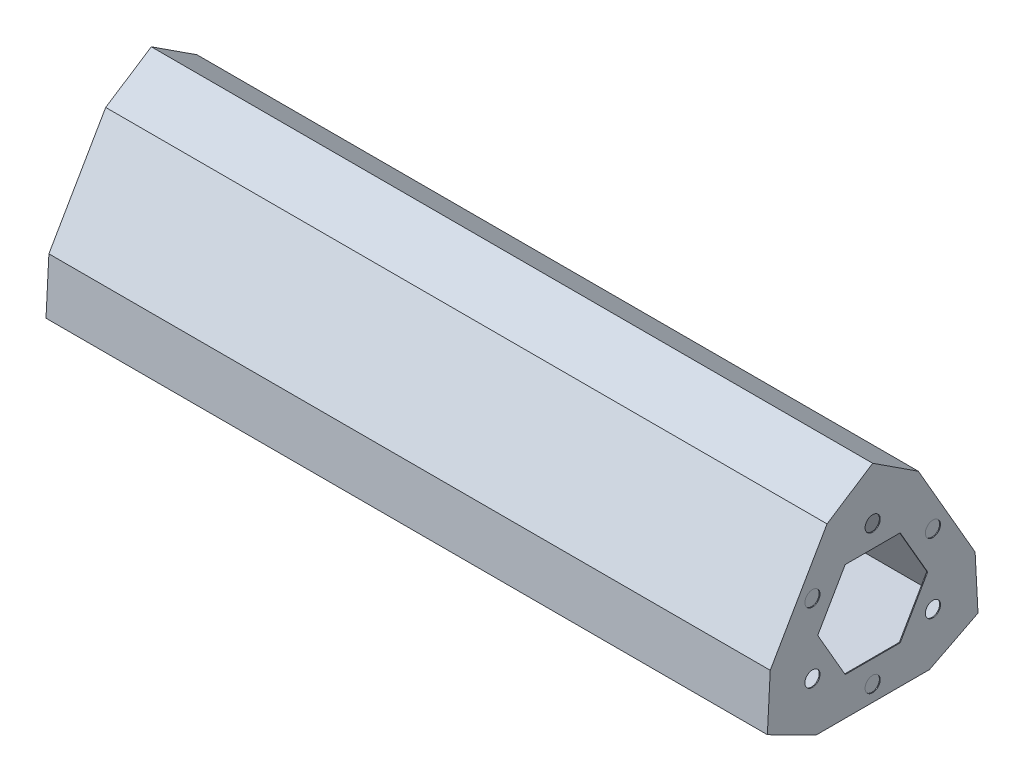
ISO-10303-21;
HEADER;
FILE_DESCRIPTION(('STEP AP214'),'2;1');
FILE_NAME('part.step','',(''),(''),'','','');
FILE_SCHEMA(('AUTOMOTIVE_DESIGN { 1 0 10303 214 1 1 1 1 }'));
ENDSEC;
DATA;
#1=APPLICATION_CONTEXT('core data for automotive mechanical design processes');
#2=APPLICATION_PROTOCOL_DEFINITION('international standard','automotive_design',2000,#1);
#3=PRODUCT_CONTEXT('',#1,'mechanical');
#4=PRODUCT('Part','Part','',(#3));
#5=PRODUCT_RELATED_PRODUCT_CATEGORY('part','',(#4));
#6=PRODUCT_DEFINITION_FORMATION('','',#4);
#7=PRODUCT_DEFINITION_CONTEXT('part definition',#1,'design');
#8=PRODUCT_DEFINITION('design','',#6,#7);
#9=PRODUCT_DEFINITION_SHAPE('','',#8);
#10=(LENGTH_UNIT() NAMED_UNIT(*) SI_UNIT(.MILLI.,.METRE.));
#11=(NAMED_UNIT(*) PLANE_ANGLE_UNIT() SI_UNIT($,.RADIAN.));
#12=(NAMED_UNIT(*) SI_UNIT($,.STERADIAN.) SOLID_ANGLE_UNIT());
#13=UNCERTAINTY_MEASURE_WITH_UNIT(LENGTH_MEASURE(1.E-05),#10,'distance_accuracy_value','');
#14=(GEOMETRIC_REPRESENTATION_CONTEXT(3) GLOBAL_UNCERTAINTY_ASSIGNED_CONTEXT((#13)) GLOBAL_UNIT_ASSIGNED_CONTEXT((#10,
#11,#12)) REPRESENTATION_CONTEXT('',''));
#15=CARTESIAN_POINT('',(0.,0.,0.));
#16=DIRECTION('',(0.,0.,1.));
#17=DIRECTION('',(1.,0.,0.));
#18=AXIS2_PLACEMENT_3D('',#15,#16,#17);
#19=CARTESIAN_POINT('',(152.4,21.8761469360305,-37.8905979670466));
#20=DIRECTION('',(0.,-0.500000000000005,0.866025403784435));
#21=DIRECTION('',(0.,-0.866025403784436,-0.500000000000006));
#22=AXIS2_PLACEMENT_3D('',#19,#20,#21);
#23=PLANE('',#22);
#24=DIRECTION('',(0.,0.866025403784436,0.500000000000006));
#25=VECTOR('',#24,1.);
#26=CARTESIAN_POINT('',(0.,21.8761469360305,-37.8905979670466));
#27=LINE('',#26,#25);
#28=CARTESIAN_POINT('',(0.,11.4838420906171,-43.8905979670468));
#29=VERTEX_POINT('',#28);
#30=CARTESIAN_POINT('',(0.,32.2684517814436,-31.8905979670466));
#31=VERTEX_POINT('',#30);
#32=EDGE_CURVE('E297',#29,#31,#27,.T.);
#33=ORIENTED_EDGE('',*,*,#32,.T.);
#34=DIRECTION('',(-1.,0.,0.));
#35=VECTOR('',#34,1.);
#36=CARTESIAN_POINT('',(152.4,32.2684517814436,-31.8905979670466));
#37=LINE('',#36,#35);
#38=CARTESIAN_POINT('',(152.4,32.2684517814436,-31.8905979670466));
#39=VERTEX_POINT('',#38);
#40=EDGE_CURVE('E12',#39,#31,#37,.T.);
#41=ORIENTED_EDGE('',*,*,#40,.F.);
#42=DIRECTION('',(0.,0.866025403784436,0.500000000000006));
#43=VECTOR('',#42,1.);
#44=CARTESIAN_POINT('',(152.4,21.8761469360305,-37.8905979670466));
#45=LINE('',#44,#43);
#46=CARTESIAN_POINT('',(152.4,11.4838420906171,-43.8905979670468));
#47=VERTEX_POINT('',#46);
#48=EDGE_CURVE('E308',#47,#39,#45,.T.);
#49=ORIENTED_EDGE('',*,*,#48,.F.);
#50=DIRECTION('',(-1.,0.,0.));
#51=VECTOR('',#50,1.);
#52=CARTESIAN_POINT('',(152.4,11.4838420906171,-43.8905979670468));
#53=LINE('',#52,#51);
#54=EDGE_CURVE('E330',#47,#29,#53,.T.);
#55=ORIENTED_EDGE('',*,*,#54,.T.);
#56=EDGE_LOOP('',(#33,#41,#49,#55));
#57=FACE_BOUND('',#56,.T.);
#58=ADVANCED_FACE('F39',(#57),#23,.F.);
#59=CARTESIAN_POINT('',(152.4,37.2525078239312,-24.2268431001882));
#60=DIRECTION('',(0.,-0.838312866699757,0.545189451040311));
#61=DIRECTION('',(0.,-0.545189451040311,-0.838312866699757));
#62=AXIS2_PLACEMENT_3D('',#59,#60,#61);
#63=PLANE('',#62);
#64=DIRECTION('',(0.,0.545189451040311,0.838312866699757));
#65=VECTOR('',#64,1.);
#66=CARTESIAN_POINT('',(0.,37.2525078239312,-24.2268431001882));
#67=LINE('',#66,#65);
#68=CARTESIAN_POINT('',(0.,38.5381304684071,-22.2499999999991));
#69=VERTEX_POINT('',#68);
#70=EDGE_CURVE('E333',#31,#69,#67,.T.);
#71=ORIENTED_EDGE('',*,*,#70,.T.);
#72=DIRECTION('',(-1.,0.,0.));
#73=VECTOR('',#72,1.);
#74=CARTESIAN_POINT('',(152.4,38.5381304684071,-22.2499999999991));
#75=LINE('',#74,#73);
#76=CARTESIAN_POINT('',(152.4,38.5381304684071,-22.2499999999991));
#77=VERTEX_POINT('',#76);
#78=EDGE_CURVE('E46',#77,#69,#75,.T.);
#79=ORIENTED_EDGE('',*,*,#78,.F.);
#80=DIRECTION('',(0.,0.545189451040311,0.838312866699757));
#81=VECTOR('',#80,1.);
#82=CARTESIAN_POINT('',(152.4,37.2525078239312,-24.2268431001882));
#83=LINE('',#82,#81);
#84=EDGE_CURVE('E311',#39,#77,#83,.T.);
#85=ORIENTED_EDGE('',*,*,#84,.F.);
#86=ORIENTED_EDGE('',*,*,#40,.T.);
#87=EDGE_LOOP('',(#71,#79,#85,#86));
#88=FACE_BOUND('',#87,.T.);
#89=ADVANCED_FACE('F374',(#88),#63,.F.);
#90=CARTESIAN_POINT('',(152.4,16.9142575679085,11.0000396802978));
#91=DIRECTION('',(0.,0.838312866699781,0.545189451040274));
#92=DIRECTION('',(0.,-0.545189451040274,0.838312866699781));
#93=AXIS2_PLACEMENT_3D('',#90,#91,#92);
#94=PLANE('',#93);
#95=DIRECTION('',(0.,0.545189451040274,-0.838312866699781));
#96=VECTOR('',#95,1.);
#97=CARTESIAN_POINT('',(0.,16.9142575679085,11.0000396802978));
#98=LINE('',#97,#96);
#99=CARTESIAN_POINT('',(0.,32.2684517814438,-12.6094020329519));
#100=VERTEX_POINT('',#99);
#101=EDGE_CURVE('E336',#100,#69,#98,.T.);
#102=ORIENTED_EDGE('',*,*,#101,.F.);
#103=DIRECTION('',(-1.,0.,0.));
#104=VECTOR('',#103,1.);
#105=CARTESIAN_POINT('',(152.4,32.2684517814438,-12.6094020329519));
#106=LINE('',#105,#104);
#107=CARTESIAN_POINT('',(152.4,32.2684517814438,-12.6094020329519));
#108=VERTEX_POINT('',#107);
#109=EDGE_CURVE('E367',#108,#100,#106,.T.);
#110=ORIENTED_EDGE('',*,*,#109,.F.);
#111=DIRECTION('',(0.,0.545189451040274,-0.838312866699781));
#112=VECTOR('',#111,1.);
#113=CARTESIAN_POINT('',(152.4,16.9142575679085,11.0000396802978));
#114=LINE('',#113,#112);
#115=EDGE_CURVE('E314',#108,#77,#114,.T.);
#116=ORIENTED_EDGE('',*,*,#115,.T.);
#117=ORIENTED_EDGE('',*,*,#78,.T.);
#118=EDGE_LOOP('',(#102,#110,#116,#117));
#119=FACE_BOUND('',#118,.T.);
#120=ADVANCED_FACE('F371',(#119),#94,.T.);
#121=CARTESIAN_POINT('',(152.4,2.60708170182693,4.51559796704751));
#122=DIRECTION('',(0.,0.49999999999999,0.866025403784444));
#123=DIRECTION('',(0.,-0.866025403784445,0.49999999999999));
#124=AXIS2_PLACEMENT_3D('',#121,#122,#123);
#125=PLANE('',#124);
#126=DIRECTION('',(0.,0.866025403784445,-0.49999999999999));
#127=VECTOR('',#126,1.);
#128=CARTESIAN_POINT('',(0.,2.60708170182693,4.51559796704751));
#129=LINE('',#128,#127);
#130=CARTESIAN_POINT('',(0.,11.4838420906171,-0.609402032952183));
#131=VERTEX_POINT('',#130);
#132=EDGE_CURVE('E339',#131,#100,#129,.T.);
#133=ORIENTED_EDGE('',*,*,#132,.F.);
#134=DIRECTION('',(-1.,0.,0.));
#135=VECTOR('',#134,1.);
#136=CARTESIAN_POINT('',(152.4,11.4838420906171,-0.609402032952183));
#137=LINE('',#136,#135);
#138=CARTESIAN_POINT('',(152.4,11.4838420906171,-0.609402032952183));
#139=VERTEX_POINT('',#138);
#140=EDGE_CURVE('E365',#139,#131,#137,.T.);
#141=ORIENTED_EDGE('',*,*,#140,.F.);
#142=DIRECTION('',(0.,0.866025403784445,-0.49999999999999));
#143=VECTOR('',#142,1.);
#144=CARTESIAN_POINT('',(152.4,2.60708170182693,4.51559796704751));
#145=LINE('',#144,#143);
#146=EDGE_CURVE('E317',#139,#108,#145,.T.);
#147=ORIENTED_EDGE('',*,*,#146,.T.);
#148=ORIENTED_EDGE('',*,*,#109,.T.);
#149=EDGE_LOOP('',(#133,#141,#147,#148));
#150=FACE_BOUND('',#149,.T.);
#151=ADVANCED_FACE('F383',(#150),#125,.T.);
#152=CARTESIAN_POINT('',(152.4,0.,0.));
#153=DIRECTION('',(0.,-0.0529914811262776,-0.998594964401505));
#154=DIRECTION('',(0.,0.998594964401505,-0.0529914811262776));
#155=AXIS2_PLACEMENT_3D('',#152,#153,#154);
#156=PLANE('',#155);
#157=DIRECTION('',(0.,-0.998594964401505,0.0529914811262776));
#158=VECTOR('',#157,1.);
#159=CARTESIAN_POINT('',(0.,0.,0.));
#160=LINE('',#159,#158);
#161=CARTESIAN_POINT('',(0.,0.,0.));
#162=VERTEX_POINT('',#161);
#163=EDGE_CURVE('E342',#131,#162,#160,.T.);
#164=ORIENTED_EDGE('',*,*,#163,.T.);
#165=DIRECTION('',(-1.,0.,0.));
#166=VECTOR('',#165,1.);
#167=CARTESIAN_POINT('',(152.4,0.,0.));
#168=LINE('',#167,#166);
#169=CARTESIAN_POINT('',(152.4,0.,0.));
#170=VERTEX_POINT('',#169);
#171=EDGE_CURVE('E362',#170,#162,#168,.T.);
#172=ORIENTED_EDGE('',*,*,#171,.F.);
#173=DIRECTION('',(0.,-0.998594964401505,0.0529914811262776));
#174=VECTOR('',#173,1.);
#175=CARTESIAN_POINT('',(152.4,0.,0.));
#176=LINE('',#175,#174);
#177=EDGE_CURVE('E320',#139,#170,#176,.T.);
#178=ORIENTED_EDGE('',*,*,#177,.F.);
#179=ORIENTED_EDGE('',*,*,#140,.T.);
#180=EDGE_LOOP('',(#164,#172,#178,#179));
#181=FACE_BOUND('',#180,.T.);
#182=ADVANCED_FACE('F411',(#181),#156,.F.);
#183=CARTESIAN_POINT('',(152.4,0.,0.));
#184=DIRECTION('',(0.,0.891304347826082,-0.453405513361187));
#185=DIRECTION('',(0.,0.453405513361187,0.891304347826083));
#186=AXIS2_PLACEMENT_3D('',#183,#184,#185);
#187=PLANE('',#186);
#188=DIRECTION('',(0.,-0.453405513361187,-0.891304347826083));
#189=VECTOR('',#188,1.);
#190=CARTESIAN_POINT('',(0.,0.,0.));
#191=LINE('',#190,#189);
#192=CARTESIAN_POINT('',(0.,-5.21416340365368,-10.25));
#193=VERTEX_POINT('',#192);
#194=EDGE_CURVE('E344',#162,#193,#191,.T.);
#195=ORIENTED_EDGE('',*,*,#194,.T.);
#196=DIRECTION('',(-1.,0.,0.));
#197=VECTOR('',#196,1.);
#198=CARTESIAN_POINT('',(152.4,-5.21416340365368,-10.25));
#199=LINE('',#198,#197);
#200=CARTESIAN_POINT('',(152.4,-5.21416340365368,-10.25));
#201=VERTEX_POINT('',#200);
#202=EDGE_CURVE('E359',#201,#193,#199,.T.);
#203=ORIENTED_EDGE('',*,*,#202,.F.);
#204=DIRECTION('',(0.,-0.453405513361187,-0.891304347826083));
#205=VECTOR('',#204,1.);
#206=CARTESIAN_POINT('',(152.4,0.,0.));
#207=LINE('',#206,#205);
#208=EDGE_CURVE('E322',#170,#201,#207,.T.);
#209=ORIENTED_EDGE('',*,*,#208,.F.);
#210=ORIENTED_EDGE('',*,*,#171,.T.);
#211=EDGE_LOOP('',(#195,#203,#209,#210));
#212=FACE_BOUND('',#211,.T.);
#213=ADVANCED_FACE('F407',(#212),#187,.F.);
#214=CARTESIAN_POINT('',(152.4,-5.21416340365397,0.));
#215=DIRECTION('',(0.,1.,0.));
#216=DIRECTION('',(0.,0.,1.));
#217=AXIS2_PLACEMENT_3D('',#214,#215,#216);
#218=PLANE('',#217);
#219=DIRECTION('',(0.,0.,-1.));
#220=VECTOR('',#219,1.);
#221=CARTESIAN_POINT('',(0.,-5.21416340365397,0.));
#222=LINE('',#221,#220);
#223=CARTESIAN_POINT('',(0.,-5.21416340365397,-34.25));
#224=VERTEX_POINT('',#223);
#225=EDGE_CURVE('E346',#193,#224,#222,.T.);
#226=ORIENTED_EDGE('',*,*,#225,.T.);
#227=DIRECTION('',(-1.,0.,0.));
#228=VECTOR('',#227,1.);
#229=CARTESIAN_POINT('',(152.4,-5.21416340365397,-34.25));
#230=LINE('',#229,#228);
#231=CARTESIAN_POINT('',(152.4,-5.21416340365397,-34.25));
#232=VERTEX_POINT('',#231);
#233=EDGE_CURVE('E356',#232,#224,#230,.T.);
#234=ORIENTED_EDGE('',*,*,#233,.F.);
#235=DIRECTION('',(0.,0.,-1.));
#236=VECTOR('',#235,1.);
#237=CARTESIAN_POINT('',(152.4,-5.21416340365397,0.));
#238=LINE('',#237,#236);
#239=EDGE_CURVE('E324',#201,#232,#238,.T.);
#240=ORIENTED_EDGE('',*,*,#239,.F.);
#241=ORIENTED_EDGE('',*,*,#202,.T.);
#242=EDGE_LOOP('',(#226,#234,#240,#241));
#243=FACE_BOUND('',#242,.T.);
#244=ADVANCED_FACE('F404',(#243),#218,.F.);
#245=CARTESIAN_POINT('',(152.4,-17.9834425897285,-9.14815689981215));
#246=DIRECTION('',(0.,0.891304347826072,0.453405513361208));
#247=DIRECTION('',(0.,-0.453405513361208,0.891304347826072));
#248=AXIS2_PLACEMENT_3D('',#245,#246,#247);
#249=PLANE('',#248);
#250=DIRECTION('',(0.,0.453405513361208,-0.891304347826072));
#251=VECTOR('',#250,1.);
#252=CARTESIAN_POINT('',(0.,-17.9834425897285,-9.14815689981215));
#253=LINE('',#252,#251);
#254=CARTESIAN_POINT('',(0.,0.,-44.5));
#255=VERTEX_POINT('',#254);
#256=EDGE_CURVE('E348',#224,#255,#253,.T.);
#257=ORIENTED_EDGE('',*,*,#256,.T.);
#258=DIRECTION('',(-1.,0.,0.));
#259=VECTOR('',#258,1.);
#260=CARTESIAN_POINT('',(152.4,0.,-44.5));
#261=LINE('',#260,#259);
#262=CARTESIAN_POINT('',(152.4,0.,-44.5));
#263=VERTEX_POINT('',#262);
#264=EDGE_CURVE('E353',#263,#255,#261,.T.);
#265=ORIENTED_EDGE('',*,*,#264,.F.);
#266=DIRECTION('',(0.,0.453405513361208,-0.891304347826072));
#267=VECTOR('',#266,1.);
#268=CARTESIAN_POINT('',(152.4,-17.9834425897285,-9.14815689981215));
#269=LINE('',#268,#267);
#270=EDGE_CURVE('E326',#232,#263,#269,.T.);
#271=ORIENTED_EDGE('',*,*,#270,.F.);
#272=ORIENTED_EDGE('',*,*,#233,.T.);
#273=EDGE_LOOP('',(#257,#265,#271,#272));
#274=FACE_BOUND('',#273,.T.);
#275=ADVANCED_FACE('F400',(#274),#249,.F.);
#276=CARTESIAN_POINT('',(152.4,2.35480766629917,-44.3750396802975));
#277=DIRECTION('',(0.,-0.0529914811263699,0.9985949644015));
#278=DIRECTION('',(0.,-0.9985949644015,-0.0529914811263699));
#279=AXIS2_PLACEMENT_3D('',#276,#277,#278);
#280=PLANE('',#279);
#281=DIRECTION('',(0.,0.9985949644015,0.0529914811263699));
#282=VECTOR('',#281,1.);
#283=CARTESIAN_POINT('',(0.,2.35480766629917,-44.3750396802975));
#284=LINE('',#283,#282);
#285=EDGE_CURVE('E312',#255,#29,#284,.T.);
#286=ORIENTED_EDGE('',*,*,#285,.T.);
#287=ORIENTED_EDGE('',*,*,#54,.F.);
#288=DIRECTION('',(0.,0.9985949644015,0.0529914811263699));
#289=VECTOR('',#288,1.);
#290=CARTESIAN_POINT('',(152.4,2.35480766629917,-44.3750396802975));
#291=LINE('',#290,#289);
#292=EDGE_CURVE('E328',#263,#47,#291,.T.);
#293=ORIENTED_EDGE('',*,*,#292,.F.);
#294=ORIENTED_EDGE('',*,*,#264,.T.);
#295=EDGE_LOOP('',(#286,#287,#293,#294));
#296=FACE_BOUND('',#295,.T.);
#297=ADVANCED_FACE('F396',(#296),#280,.F.);
#298=CARTESIAN_POINT('',(152.4,0.,0.));
#299=DIRECTION('',(1.,0.,0.));
#300=DIRECTION('',(0.,0.,-1.));
#301=AXIS2_PLACEMENT_3D('',#298,#299,#300);
#302=PLANE('',#301);
#303=CARTESIAN_POINT('',(152.4,20.1920869789371,-9.52627944162922));
#304=DIRECTION('',(1.,0.,0.));
#305=DIRECTION('',(0.,0.,-1.));
#306=AXIS2_PLACEMENT_3D('',#303,#304,#305);
#307=CIRCLE('',#306,1.59999999999996);
#308=CARTESIAN_POINT('',(152.4,20.1920869789371,-11.1262794416292));
#309=VERTEX_POINT('',#308);
#310=EDGE_CURVE('E241',#309,#309,#307,.T.);
#311=ORIENTED_EDGE('',*,*,#310,.F.);
#312=EDGE_LOOP('',(#311));
#313=FACE_BOUND('',#312,.T.);
#314=CARTESIAN_POINT('',(152.4,5.4999999999991,-9.52627944163036));
#315=DIRECTION('',(1.,0.,0.));
#316=DIRECTION('',(0.,0.,-1.));
#317=AXIS2_PLACEMENT_3D('',#314,#315,#316);
#318=CIRCLE('',#317,1.59999999999933);
#319=CARTESIAN_POINT('',(152.4,5.4999999999991,-11.1262794416297));
#320=VERTEX_POINT('',#319);
#321=EDGE_CURVE('E256',#320,#320,#318,.T.);
#322=ORIENTED_EDGE('',*,*,#321,.F.);
#323=EDGE_LOOP('',(#322));
#324=FACE_BOUND('',#323,.T.);
#325=CARTESIAN_POINT('',(152.4,-1.84604348946889,-22.2500000000018));
#326=DIRECTION('',(1.,0.,0.));
#327=DIRECTION('',(0.,0.,-1.));
#328=AXIS2_PLACEMENT_3D('',#325,#326,#327);
#329=CIRCLE('',#328,1.59999999999944);
#330=CARTESIAN_POINT('',(152.4,-1.84604348946889,-23.8500000000012));
#331=VERTEX_POINT('',#330);
#332=EDGE_CURVE('E253',#331,#331,#329,.T.);
#333=ORIENTED_EDGE('',*,*,#332,.F.);
#334=EDGE_LOOP('',(#333));
#335=FACE_BOUND('',#334,.T.);
#336=CARTESIAN_POINT('',(152.4,5.50000000000108,-34.9737205583721));
#337=DIRECTION('',(1.,0.,0.));
#338=DIRECTION('',(0.,0.,-1.));
#339=AXIS2_PLACEMENT_3D('',#336,#337,#338);
#340=CIRCLE('',#339,1.60000000000013);
#341=CARTESIAN_POINT('',(152.4,5.50000000000108,-36.5737205583722));
#342=VERTEX_POINT('',#341);
#343=EDGE_CURVE('E245',#342,#342,#340,.T.);
#344=ORIENTED_EDGE('',*,*,#343,.F.);
#345=EDGE_LOOP('',(#344));
#346=FACE_BOUND('',#345,.T.);
#347=CARTESIAN_POINT('',(152.4,27.538130468407,-22.2499999999995));
#348=DIRECTION('',(1.,0.,0.));
#349=DIRECTION('',(0.,0.,-1.));
#350=AXIS2_PLACEMENT_3D('',#347,#348,#349);
#351=CIRCLE('',#350,1.60000000000047);
#352=CARTESIAN_POINT('',(152.4,27.538130468407,-23.85));
#353=VERTEX_POINT('',#352);
#354=EDGE_CURVE('E237',#353,#353,#351,.T.);
#355=ORIENTED_EDGE('',*,*,#354,.F.);
#356=EDGE_LOOP('',(#355));
#357=FACE_BOUND('',#356,.T.);
#358=CARTESIAN_POINT('',(152.4,20.192086978939,-34.9737205583709));
#359=DIRECTION('',(1.,0.,0.));
#360=DIRECTION('',(0.,0.,-1.));
#361=AXIS2_PLACEMENT_3D('',#358,#359,#360);
#362=CIRCLE('',#361,1.60000000000063);
#363=CARTESIAN_POINT('',(152.4,20.192086978939,-36.5737205583715));
#364=VERTEX_POINT('',#363);
#365=EDGE_CURVE('E234',#364,#364,#362,.T.);
#366=ORIENTED_EDGE('',*,*,#365,.F.);
#367=EDGE_LOOP('',(#366));
#368=FACE_BOUND('',#367,.T.);
#369=DIRECTION('',(0.,0.,1.));
#370=VECTOR('',#369,1.);
#371=CARTESIAN_POINT('',(152.4,22.9062503825923,-28.058263157847));
#372=LINE('',#371,#370);
#373=CARTESIAN_POINT('',(152.4,22.9062503825923,-28.058263157847));
#374=VERTEX_POINT('',#373);
#375=CARTESIAN_POINT('',(152.4,22.9062503825923,-16.4417368421512));
#376=VERTEX_POINT('',#375);
#377=EDGE_CURVE('E233',#374,#376,#372,.T.);
#378=ORIENTED_EDGE('',*,*,#377,.F.);
#379=DIRECTION('',(0.,0.866025403784439,0.5));
#380=VECTOR('',#379,1.);
#381=CARTESIAN_POINT('',(152.4,12.8460434894693,-33.8665263156949));
#382=LINE('',#381,#380);
#383=CARTESIAN_POINT('',(152.4,12.8460434894693,-33.8665263156949));
#384=VERTEX_POINT('',#383);
#385=EDGE_CURVE('E269',#384,#374,#382,.T.);
#386=ORIENTED_EDGE('',*,*,#385,.F.);
#387=DIRECTION('',(0.,0.866025403784439,-0.5));
#388=VECTOR('',#387,1.);
#389=CARTESIAN_POINT('',(152.4,2.78583659634632,-28.058263157847));
#390=LINE('',#389,#388);
#391=CARTESIAN_POINT('',(152.4,2.78583659634632,-28.058263157847));
#392=VERTEX_POINT('',#391);
#393=EDGE_CURVE('E290',#392,#384,#390,.T.);
#394=ORIENTED_EDGE('',*,*,#393,.F.);
#395=DIRECTION('',(0.,0.,-1.));
#396=VECTOR('',#395,1.);
#397=CARTESIAN_POINT('',(152.4,2.78583659634632,-16.4417368421512));
#398=LINE('',#397,#396);
#399=CARTESIAN_POINT('',(152.4,2.78583659634632,-16.4417368421512));
#400=VERTEX_POINT('',#399);
#401=EDGE_CURVE('E287',#400,#392,#398,.T.);
#402=ORIENTED_EDGE('',*,*,#401,.F.);
#403=DIRECTION('',(0.,-0.866025403784439,-0.5));
#404=VECTOR('',#403,1.);
#405=CARTESIAN_POINT('',(152.4,12.8460434894693,-10.6334736843033));
#406=LINE('',#405,#404);
#407=CARTESIAN_POINT('',(152.4,12.8460434894693,-10.6334736843033));
#408=VERTEX_POINT('',#407);
#409=EDGE_CURVE('E284',#408,#400,#406,.T.);
#410=ORIENTED_EDGE('',*,*,#409,.F.);
#411=DIRECTION('',(0.,-0.866025403784439,0.5));
#412=VECTOR('',#411,1.);
#413=CARTESIAN_POINT('',(152.4,22.9062503825923,-16.4417368421512));
#414=LINE('',#413,#412);
#415=EDGE_CURVE('E281',#376,#408,#414,.T.);
#416=ORIENTED_EDGE('',*,*,#415,.F.);
#417=EDGE_LOOP('',(#378,#386,#394,#402,#410,#416));
#418=FACE_BOUND('',#417,.T.);
#419=ORIENTED_EDGE('',*,*,#48,.T.);
#420=ORIENTED_EDGE('',*,*,#84,.T.);
#421=ORIENTED_EDGE('',*,*,#115,.F.);
#422=ORIENTED_EDGE('',*,*,#146,.F.);
#423=ORIENTED_EDGE('',*,*,#177,.T.);
#424=ORIENTED_EDGE('',*,*,#208,.T.);
#425=ORIENTED_EDGE('',*,*,#239,.T.);
#426=ORIENTED_EDGE('',*,*,#270,.T.);
#427=ORIENTED_EDGE('',*,*,#292,.T.);
#428=EDGE_LOOP('',(#419,#420,#421,#422,#423,#424,#425,#426,#427));
#429=FACE_BOUND('',#428,.T.);
#430=ADVANCED_FACE('F387',(#313,#324,#335,#346,#357,#368,#418,#429),#302,.T.);
#431=CARTESIAN_POINT('',(0.,0.,0.));
#432=DIRECTION('',(1.,0.,0.));
#433=DIRECTION('',(0.,0.,-1.));
#434=AXIS2_PLACEMENT_3D('',#431,#432,#433);
#435=PLANE('',#434);
#436=CARTESIAN_POINT('',(0.,3.93856620135815,-22.2499999999997));
#437=DIRECTION('',(-1.,0.,0.));
#438=DIRECTION('',(0.,0.,1.));
#439=AXIS2_PLACEMENT_3D('',#436,#437,#438);
#440=CIRCLE('',#439,1.60000000000022);
#441=CARTESIAN_POINT('',(0.,3.93856620135815,-20.6499999999995));
#442=VERTEX_POINT('',#441);
#443=EDGE_CURVE('E752',#442,#442,#440,.T.);
#444=ORIENTED_EDGE('',*,*,#443,.F.);
#445=EDGE_LOOP('',(#444));
#446=FACE_BOUND('',#445,.T.);
#447=CARTESIAN_POINT('',(0.,17.2997821335251,-14.5358983848622));
#448=DIRECTION('',(-1.,0.,0.));
#449=DIRECTION('',(0.,0.,1.));
#450=AXIS2_PLACEMENT_3D('',#447,#448,#449);
#451=CIRCLE('',#450,1.60000000000037);
#452=CARTESIAN_POINT('',(0.,17.2997821335251,-12.9358983848618));
#453=VERTEX_POINT('',#452);
#454=EDGE_CURVE('E756',#453,#453,#451,.T.);
#455=ORIENTED_EDGE('',*,*,#454,.F.);
#456=EDGE_LOOP('',(#455));
#457=FACE_BOUND('',#456,.T.);
#458=CARTESIAN_POINT('',(0.,17.2997821335252,-29.9641016151369));
#459=DIRECTION('',(-1.,0.,0.));
#460=DIRECTION('',(0.,0.,1.));
#461=AXIS2_PLACEMENT_3D('',#458,#459,#460);
#462=CIRCLE('',#461,1.59999999999932);
#463=CARTESIAN_POINT('',(0.,17.2997821335252,-28.3641016151376));
#464=VERTEX_POINT('',#463);
#465=EDGE_CURVE('E766',#464,#464,#462,.T.);
#466=ORIENTED_EDGE('',*,*,#465,.F.);
#467=EDGE_LOOP('',(#466));
#468=FACE_BOUND('',#467,.T.);
#469=DIRECTION('',(0.,0.,1.));
#470=VECTOR('',#469,1.);
#471=CARTESIAN_POINT('',(0.,7.93856620135751,-30.7499999999991));
#472=LINE('',#471,#470);
#473=CARTESIAN_POINT('',(0.,7.93856620135751,-30.7499999999991));
#474=VERTEX_POINT('',#473);
#475=CARTESIAN_POINT('',(0.,7.93856620135751,-13.7499999999991));
#476=VERTEX_POINT('',#475);
#477=EDGE_CURVE('E53',#474,#476,#472,.T.);
#478=ORIENTED_EDGE('',*,*,#477,.F.);
#479=DIRECTION('',(0.,-0.866025403784439,-0.5));
#480=VECTOR('',#479,1.);
#481=CARTESIAN_POINT('',(0.,22.660998065693,-22.2499999999991));
#482=LINE('',#481,#480);
#483=CARTESIAN_POINT('',(0.,22.660998065693,-22.2499999999991));
#484=VERTEX_POINT('',#483);
#485=EDGE_CURVE('E194',#484,#474,#482,.T.);
#486=ORIENTED_EDGE('',*,*,#485,.F.);
#487=DIRECTION('',(0.,0.866025403784439,-0.5));
#488=VECTOR('',#487,1.);
#489=CARTESIAN_POINT('',(0.,7.93856620135751,-13.7499999999991));
#490=LINE('',#489,#488);
#491=EDGE_CURVE('E203',#476,#484,#490,.T.);
#492=ORIENTED_EDGE('',*,*,#491,.F.);
#493=EDGE_LOOP('',(#478,#486,#492));
#494=FACE_BOUND('',#493,.T.);
#495=ORIENTED_EDGE('',*,*,#32,.F.);
#496=ORIENTED_EDGE('',*,*,#285,.F.);
#497=ORIENTED_EDGE('',*,*,#256,.F.);
#498=ORIENTED_EDGE('',*,*,#225,.F.);
#499=ORIENTED_EDGE('',*,*,#194,.F.);
#500=ORIENTED_EDGE('',*,*,#163,.F.);
#501=ORIENTED_EDGE('',*,*,#132,.T.);
#502=ORIENTED_EDGE('',*,*,#101,.T.);
#503=ORIENTED_EDGE('',*,*,#70,.F.);
#504=EDGE_LOOP('',(#495,#496,#497,#498,#499,#500,#501,#502,#503));
#505=FACE_BOUND('',#504,.T.);
#506=ADVANCED_FACE('F378',(#446,#457,#468,#494,#505),#435,.F.);
#507=CARTESIAN_POINT('',(152.2222,22.9062503825923,-28.058263157847));
#508=DIRECTION('',(0.,1.,0.));
#509=DIRECTION('',(0.,0.,1.));
#510=AXIS2_PLACEMENT_3D('',#507,#508,#509);
#511=PLANE('',#510);
#512=ORIENTED_EDGE('',*,*,#377,.T.);
#513=DIRECTION('',(1.,0.,0.));
#514=VECTOR('',#513,1.);
#515=CARTESIAN_POINT('',(152.2222,22.9062503825923,-16.4417368421512));
#516=LINE('',#515,#514);
#517=CARTESIAN_POINT('',(152.2222,22.9062503825923,-16.4417368421512));
#518=VERTEX_POINT('',#517);
#519=EDGE_CURVE('E279',#518,#376,#516,.T.);
#520=ORIENTED_EDGE('',*,*,#519,.F.);
#521=DIRECTION('',(0.,0.,1.));
#522=VECTOR('',#521,1.);
#523=CARTESIAN_POINT('',(152.2222,22.9062503825923,-28.058263157847));
#524=LINE('',#523,#522);
#525=CARTESIAN_POINT('',(152.2222,22.9062503825923,-28.058263157847));
#526=VERTEX_POINT('',#525);
#527=EDGE_CURVE('E266',#526,#518,#524,.T.);
#528=ORIENTED_EDGE('',*,*,#527,.F.);
#529=DIRECTION('',(1.,0.,0.));
#530=VECTOR('',#529,1.);
#531=CARTESIAN_POINT('',(152.2222,22.9062503825923,-28.058263157847));
#532=LINE('',#531,#530);
#533=EDGE_CURVE('E295',#526,#374,#532,.T.);
#534=ORIENTED_EDGE('',*,*,#533,.T.);
#535=EDGE_LOOP('',(#512,#520,#528,#534));
#536=FACE_BOUND('',#535,.T.);
#537=ADVANCED_FACE('F583',(#536),#511,.F.);
#538=CARTESIAN_POINT('',(152.2222,12.8460434894693,-33.8665263156949));
#539=DIRECTION('',(0.,0.5,-0.866025403784439));
#540=DIRECTION('',(0.,0.866025403784439,0.5));
#541=AXIS2_PLACEMENT_3D('',#538,#539,#540);
#542=PLANE('',#541);
#543=ORIENTED_EDGE('',*,*,#385,.T.);
#544=ORIENTED_EDGE('',*,*,#533,.F.);
#545=DIRECTION('',(0.,0.866025403784439,0.5));
#546=VECTOR('',#545,1.);
#547=CARTESIAN_POINT('',(152.2222,12.8460434894693,-33.8665263156949));
#548=LINE('',#547,#546);
#549=CARTESIAN_POINT('',(152.2222,12.8460434894693,-33.8665263156949));
#550=VERTEX_POINT('',#549);
#551=EDGE_CURVE('E277',#550,#526,#548,.T.);
#552=ORIENTED_EDGE('',*,*,#551,.F.);
#553=DIRECTION('',(1.,0.,0.));
#554=VECTOR('',#553,1.);
#555=CARTESIAN_POINT('',(152.2222,12.8460434894693,-33.8665263156949));
#556=LINE('',#555,#554);
#557=EDGE_CURVE('E298',#550,#384,#556,.T.);
#558=ORIENTED_EDGE('',*,*,#557,.T.);
#559=EDGE_LOOP('',(#543,#544,#552,#558));
#560=FACE_BOUND('',#559,.T.);
#561=ADVANCED_FACE('F588',(#560),#542,.F.);
#562=CARTESIAN_POINT('',(152.2222,2.78583659634632,-28.058263157847));
#563=DIRECTION('',(0.,-0.5,-0.866025403784439));
#564=DIRECTION('',(0.,0.866025403784439,-0.5));
#565=AXIS2_PLACEMENT_3D('',#562,#563,#564);
#566=PLANE('',#565);
#567=ORIENTED_EDGE('',*,*,#393,.T.);
#568=ORIENTED_EDGE('',*,*,#557,.F.);
#569=DIRECTION('',(0.,0.866025403784439,-0.5));
#570=VECTOR('',#569,1.);
#571=CARTESIAN_POINT('',(152.2222,2.78583659634632,-28.058263157847));
#572=LINE('',#571,#570);
#573=CARTESIAN_POINT('',(152.2222,2.78583659634632,-28.058263157847));
#574=VERTEX_POINT('',#573);
#575=EDGE_CURVE('E275',#574,#550,#572,.T.);
#576=ORIENTED_EDGE('',*,*,#575,.F.);
#577=DIRECTION('',(1.,0.,0.));
#578=VECTOR('',#577,1.);
#579=CARTESIAN_POINT('',(152.2222,2.78583659634632,-28.058263157847));
#580=LINE('',#579,#578);
#581=EDGE_CURVE('E300',#574,#392,#580,.T.);
#582=ORIENTED_EDGE('',*,*,#581,.T.);
#583=EDGE_LOOP('',(#567,#568,#576,#582));
#584=FACE_BOUND('',#583,.T.);
#585=ADVANCED_FACE('F599',(#584),#566,.F.);
#586=CARTESIAN_POINT('',(152.2222,2.78583659634632,-16.4417368421512));
#587=DIRECTION('',(0.,-1.,0.));
#588=DIRECTION('',(0.,0.,-1.));
#589=AXIS2_PLACEMENT_3D('',#586,#587,#588);
#590=PLANE('',#589);
#591=ORIENTED_EDGE('',*,*,#401,.T.);
#592=ORIENTED_EDGE('',*,*,#581,.F.);
#593=DIRECTION('',(0.,0.,-1.));
#594=VECTOR('',#593,1.);
#595=CARTESIAN_POINT('',(152.2222,2.78583659634632,-16.4417368421512));
#596=LINE('',#595,#594);
#597=CARTESIAN_POINT('',(152.2222,2.78583659634632,-16.4417368421512));
#598=VERTEX_POINT('',#597);
#599=EDGE_CURVE('E273',#598,#574,#596,.T.);
#600=ORIENTED_EDGE('',*,*,#599,.F.);
#601=DIRECTION('',(1.,0.,0.));
#602=VECTOR('',#601,1.);
#603=CARTESIAN_POINT('',(152.2222,2.78583659634632,-16.4417368421512));
#604=LINE('',#603,#602);
#605=EDGE_CURVE('E302',#598,#400,#604,.T.);
#606=ORIENTED_EDGE('',*,*,#605,.T.);
#607=EDGE_LOOP('',(#591,#592,#600,#606));
#608=FACE_BOUND('',#607,.T.);
#609=ADVANCED_FACE('F609',(#608),#590,.F.);
#610=CARTESIAN_POINT('',(152.2222,12.8460434894693,-10.6334736843033));
#611=DIRECTION('',(0.,-0.5,0.866025403784439));
#612=DIRECTION('',(0.,-0.866025403784439,-0.5));
#613=AXIS2_PLACEMENT_3D('',#610,#611,#612);
#614=PLANE('',#613);
#615=ORIENTED_EDGE('',*,*,#409,.T.);
#616=ORIENTED_EDGE('',*,*,#605,.F.);
#617=DIRECTION('',(0.,-0.866025403784439,-0.5));
#618=VECTOR('',#617,1.);
#619=CARTESIAN_POINT('',(152.2222,12.8460434894693,-10.6334736843033));
#620=LINE('',#619,#618);
#621=CARTESIAN_POINT('',(152.2222,12.8460434894693,-10.6334736843033));
#622=VERTEX_POINT('',#621);
#623=EDGE_CURVE('E271',#622,#598,#620,.T.);
#624=ORIENTED_EDGE('',*,*,#623,.F.);
#625=DIRECTION('',(1.,0.,0.));
#626=VECTOR('',#625,1.);
#627=CARTESIAN_POINT('',(152.2222,12.8460434894693,-10.6334736843033));
#628=LINE('',#627,#626);
#629=EDGE_CURVE('E304',#622,#408,#628,.T.);
#630=ORIENTED_EDGE('',*,*,#629,.T.);
#631=EDGE_LOOP('',(#615,#616,#624,#630));
#632=FACE_BOUND('',#631,.T.);
#633=ADVANCED_FACE('F619',(#632),#614,.F.);
#634=CARTESIAN_POINT('',(152.2222,22.9062503825923,-16.4417368421512));
#635=DIRECTION('',(0.,0.5,0.866025403784439));
#636=DIRECTION('',(0.,-0.866025403784439,0.5));
#637=AXIS2_PLACEMENT_3D('',#634,#635,#636);
#638=PLANE('',#637);
#639=ORIENTED_EDGE('',*,*,#415,.T.);
#640=ORIENTED_EDGE('',*,*,#629,.F.);
#641=DIRECTION('',(0.,-0.866025403784439,0.5));
#642=VECTOR('',#641,1.);
#643=CARTESIAN_POINT('',(152.2222,22.9062503825923,-16.4417368421512));
#644=LINE('',#643,#642);
#645=EDGE_CURVE('E268',#518,#622,#644,.T.);
#646=ORIENTED_EDGE('',*,*,#645,.F.);
#647=ORIENTED_EDGE('',*,*,#519,.T.);
#648=EDGE_LOOP('',(#639,#640,#646,#647));
#649=FACE_BOUND('',#648,.T.);
#650=ADVANCED_FACE('F493',(#649),#638,.F.);
#651=CARTESIAN_POINT('',(152.2222,20.192086978939,-34.9737205583709));
#652=DIRECTION('',(1.,0.,0.));
#653=DIRECTION('',(0.,0.,-1.));
#654=AXIS2_PLACEMENT_3D('',#651,#652,#653);
#655=CYLINDRICAL_SURFACE('',#654,1.60000000000063);
#656=CARTESIAN_POINT('',(152.2222,20.192086978939,-34.9737205583709));
#657=DIRECTION('',(1.,0.,0.));
#658=DIRECTION('',(0.,0.,-1.));
#659=AXIS2_PLACEMENT_3D('',#656,#657,#658);
#660=CIRCLE('',#659,1.60000000000063);
#661=CARTESIAN_POINT('',(152.2222,20.192086978939,-36.5737205583715));
#662=VERTEX_POINT('',#661);
#663=EDGE_CURVE('E230',#662,#662,#660,.T.);
#664=ORIENTED_EDGE('',*,*,#663,.F.);
#665=EDGE_LOOP('',(#664));
#666=FACE_BOUND('',#665,.T.);
#667=ORIENTED_EDGE('',*,*,#365,.T.);
#668=EDGE_LOOP('',(#667));
#669=FACE_BOUND('',#668,.T.);
#670=ADVANCED_FACE('F487',(#666,#669),#655,.F.);
#671=CARTESIAN_POINT('',(152.2222,20.192086978939,-34.9737205583709));
#672=DIRECTION('',(1.,0.,0.));
#673=DIRECTION('',(0.,0.,-1.));
#674=AXIS2_PLACEMENT_3D('',#671,#672,#673);
#675=PLANE('',#674);
#676=ORIENTED_EDGE('',*,*,#663,.T.);
#677=EDGE_LOOP('',(#676));
#678=FACE_BOUND('',#677,.T.);
#679=ADVANCED_FACE('F492',(#678),#675,.T.);
#680=CARTESIAN_POINT('',(152.2222,27.538130468407,-22.2499999999995));
#681=DIRECTION('',(1.,0.,0.));
#682=DIRECTION('',(0.,0.,-1.));
#683=AXIS2_PLACEMENT_3D('',#680,#681,#682);
#684=CYLINDRICAL_SURFACE('',#683,1.60000000000047);
#685=CARTESIAN_POINT('',(152.2222,27.538130468407,-22.2499999999995));
#686=DIRECTION('',(1.,0.,0.));
#687=DIRECTION('',(0.,0.,-1.));
#688=AXIS2_PLACEMENT_3D('',#685,#686,#687);
#689=CIRCLE('',#688,1.60000000000047);
#690=CARTESIAN_POINT('',(152.2222,27.538130468407,-23.85));
#691=VERTEX_POINT('',#690);
#692=EDGE_CURVE('E238',#691,#691,#689,.T.);
#693=ORIENTED_EDGE('',*,*,#692,.F.);
#694=EDGE_LOOP('',(#693));
#695=FACE_BOUND('',#694,.T.);
#696=ORIENTED_EDGE('',*,*,#354,.T.);
#697=EDGE_LOOP('',(#696));
#698=FACE_BOUND('',#697,.T.);
#699=ADVANCED_FACE('F505',(#695,#698),#684,.F.);
#700=CARTESIAN_POINT('',(152.2222,5.50000000000108,-34.9737205583721));
#701=DIRECTION('',(1.,0.,0.));
#702=DIRECTION('',(0.,0.,-1.));
#703=AXIS2_PLACEMENT_3D('',#700,#701,#702);
#704=CYLINDRICAL_SURFACE('',#703,1.60000000000013);
#705=CARTESIAN_POINT('',(152.2222,5.50000000000108,-34.9737205583721));
#706=DIRECTION('',(1.,0.,0.));
#707=DIRECTION('',(0.,0.,-1.));
#708=AXIS2_PLACEMENT_3D('',#705,#706,#707);
#709=CIRCLE('',#708,1.60000000000013);
#710=CARTESIAN_POINT('',(152.2222,5.50000000000108,-36.5737205583722));
#711=VERTEX_POINT('',#710);
#712=EDGE_CURVE('E242',#711,#711,#709,.T.);
#713=ORIENTED_EDGE('',*,*,#712,.F.);
#714=EDGE_LOOP('',(#713));
#715=FACE_BOUND('',#714,.T.);
#716=ORIENTED_EDGE('',*,*,#343,.T.);
#717=EDGE_LOOP('',(#716));
#718=FACE_BOUND('',#717,.T.);
#719=ADVANCED_FACE('F515',(#715,#718),#704,.F.);
#720=CARTESIAN_POINT('',(152.2222,-1.84604348946889,-22.2500000000018));
#721=DIRECTION('',(1.,0.,0.));
#722=DIRECTION('',(0.,0.,-1.));
#723=AXIS2_PLACEMENT_3D('',#720,#721,#722);
#724=CYLINDRICAL_SURFACE('',#723,1.59999999999944);
#725=CARTESIAN_POINT('',(152.2222,-1.84604348946889,-22.2500000000018));
#726=DIRECTION('',(1.,0.,0.));
#727=DIRECTION('',(0.,0.,-1.));
#728=AXIS2_PLACEMENT_3D('',#725,#726,#727);
#729=CIRCLE('',#728,1.59999999999944);
#730=CARTESIAN_POINT('',(152.2222,-1.84604348946889,-23.8500000000012));
#731=VERTEX_POINT('',#730);
#732=EDGE_CURVE('E250',#731,#731,#729,.T.);
#733=ORIENTED_EDGE('',*,*,#732,.F.);
#734=EDGE_LOOP('',(#733));
#735=FACE_BOUND('',#734,.T.);
#736=ORIENTED_EDGE('',*,*,#332,.T.);
#737=EDGE_LOOP('',(#736));
#738=FACE_BOUND('',#737,.T.);
#739=ADVANCED_FACE('F525',(#735,#738),#724,.F.);
#740=CARTESIAN_POINT('',(152.2222,-1.84604348946889,-22.2500000000018));
#741=DIRECTION('',(1.,0.,0.));
#742=DIRECTION('',(0.,0.,-1.));
#743=AXIS2_PLACEMENT_3D('',#740,#741,#742);
#744=PLANE('',#743);
#745=ORIENTED_EDGE('',*,*,#732,.T.);
#746=EDGE_LOOP('',(#745));
#747=FACE_BOUND('',#746,.T.);
#748=ADVANCED_FACE('F535',(#747),#744,.T.);
#749=CARTESIAN_POINT('',(152.2222,5.4999999999991,-9.52627944163036));
#750=DIRECTION('',(1.,0.,0.));
#751=DIRECTION('',(0.,0.,-1.));
#752=AXIS2_PLACEMENT_3D('',#749,#750,#751);
#753=CYLINDRICAL_SURFACE('',#752,1.59999999999933);
#754=CARTESIAN_POINT('',(152.2222,5.4999999999991,-9.52627944163036));
#755=DIRECTION('',(1.,0.,0.));
#756=DIRECTION('',(0.,0.,-1.));
#757=AXIS2_PLACEMENT_3D('',#754,#755,#756);
#758=CIRCLE('',#757,1.59999999999933);
#759=CARTESIAN_POINT('',(152.2222,5.4999999999991,-11.1262794416297));
#760=VERTEX_POINT('',#759);
#761=EDGE_CURVE('E229',#760,#760,#758,.T.);
#762=ORIENTED_EDGE('',*,*,#761,.F.);
#763=EDGE_LOOP('',(#762));
#764=FACE_BOUND('',#763,.T.);
#765=ORIENTED_EDGE('',*,*,#321,.T.);
#766=EDGE_LOOP('',(#765));
#767=FACE_BOUND('',#766,.T.);
#768=ADVANCED_FACE('F545',(#764,#767),#753,.F.);
#769=CARTESIAN_POINT('',(152.2222,20.1920869789371,-9.52627944162922));
#770=DIRECTION('',(1.,0.,0.));
#771=DIRECTION('',(0.,0.,-1.));
#772=AXIS2_PLACEMENT_3D('',#769,#770,#771);
#773=CYLINDRICAL_SURFACE('',#772,1.59999999999996);
#774=CARTESIAN_POINT('',(152.2222,20.1920869789371,-9.52627944162922));
#775=DIRECTION('',(1.,0.,0.));
#776=DIRECTION('',(0.,0.,-1.));
#777=AXIS2_PLACEMENT_3D('',#774,#775,#776);
#778=CIRCLE('',#777,1.59999999999996);
#779=CARTESIAN_POINT('',(152.2222,20.1920869789371,-11.1262794416292));
#780=VERTEX_POINT('',#779);
#781=EDGE_CURVE('E261',#780,#780,#778,.T.);
#782=ORIENTED_EDGE('',*,*,#781,.F.);
#783=EDGE_LOOP('',(#782));
#784=FACE_BOUND('',#783,.T.);
#785=ORIENTED_EDGE('',*,*,#310,.T.);
#786=EDGE_LOOP('',(#785));
#787=FACE_BOUND('',#786,.T.);
#788=ADVANCED_FACE('F555',(#784,#787),#773,.F.);
#789=CARTESIAN_POINT('',(152.2222,20.1920869789371,-9.52627944162922));
#790=DIRECTION('',(1.,0.,0.));
#791=DIRECTION('',(0.,0.,-1.));
#792=AXIS2_PLACEMENT_3D('',#789,#790,#791);
#793=PLANE('',#792);
#794=ORIENTED_EDGE('',*,*,#781,.T.);
#795=EDGE_LOOP('',(#794));
#796=FACE_BOUND('',#795,.T.);
#797=ADVANCED_FACE('F565',(#796),#793,.T.);
#798=CARTESIAN_POINT('',(-53.1397470524909,1.25000000000048,-42.3349364905375));
#799=DIRECTION('',(0.,0.5,-0.866025403784439));
#800=DIRECTION('',(0.,0.866025403784439,0.5));
#801=AXIS2_PLACEMENT_3D('',#798,#799,#800);
#802=PLANE('',#801);
#803=DIRECTION('',(0.,-0.866025403784439,-0.5));
#804=VECTOR('',#803,1.);
#805=CARTESIAN_POINT('',(0.177799999999999,1.25000000000048,-42.3349364905375));
#806=LINE('',#805,#804);
#807=CARTESIAN_POINT('',(0.177799999999999,36.0381304684071,-22.2499999999991));
#808=VERTEX_POINT('',#807);
#809=CARTESIAN_POINT('',(0.177799999999999,1.25000000000048,-42.3349364905375));
#810=VERTEX_POINT('',#809);
#811=EDGE_CURVE('E211',#808,#810,#806,.T.);
#812=ORIENTED_EDGE('',*,*,#811,.T.);
#813=DIRECTION('',(1.,0.,0.));
#814=VECTOR('',#813,1.);
#815=CARTESIAN_POINT('',(-53.1397470524909,1.25000000000048,-42.3349364905375));
#816=LINE('',#815,#814);
#817=CARTESIAN_POINT('',(152.2222,1.25000000000048,-42.3349364905375));
#818=VERTEX_POINT('',#817);
#819=EDGE_CURVE('E212',#810,#818,#816,.T.);
#820=ORIENTED_EDGE('',*,*,#819,.T.);
#821=DIRECTION('',(0.,0.866025403784439,0.5));
#822=VECTOR('',#821,1.);
#823=CARTESIAN_POINT('',(152.2222,1.25000000000048,-42.3349364905375));
#824=LINE('',#823,#822);
#825=CARTESIAN_POINT('',(152.2222,36.0381304684071,-22.2499999999991));
#826=VERTEX_POINT('',#825);
#827=EDGE_CURVE('E208',#818,#826,#824,.T.);
#828=ORIENTED_EDGE('',*,*,#827,.T.);
#829=DIRECTION('',(1.,0.,0.));
#830=VECTOR('',#829,1.);
#831=CARTESIAN_POINT('',(-53.1397470524909,36.0381304684071,-22.2499999999991));
#832=LINE('',#831,#830);
#833=EDGE_CURVE('E223',#808,#826,#832,.T.);
#834=ORIENTED_EDGE('',*,*,#833,.F.);
#835=EDGE_LOOP('',(#812,#820,#828,#834));
#836=FACE_BOUND('',#835,.T.);
#837=ADVANCED_FACE('F575',(#836),#802,.F.);
#838=CARTESIAN_POINT('',(-53.1397470524909,1.25000000000048,-2.16506350946078));
#839=DIRECTION('',(0.,-1.,0.));
#840=DIRECTION('',(0.,0.,-1.));
#841=AXIS2_PLACEMENT_3D('',#838,#839,#840);
#842=PLANE('',#841);
#843=DIRECTION('',(0.,0.,1.));
#844=VECTOR('',#843,1.);
#845=CARTESIAN_POINT('',(0.177799999999999,1.25000000000048,-2.16506350946078));
#846=LINE('',#845,#844);
#847=CARTESIAN_POINT('',(0.177799999999999,1.25000000000048,-2.16506350946078));
#848=VERTEX_POINT('',#847);
#849=EDGE_CURVE('E209',#810,#848,#846,.T.);
#850=ORIENTED_EDGE('',*,*,#849,.T.);
#851=DIRECTION('',(1.,0.,0.));
#852=VECTOR('',#851,1.);
#853=CARTESIAN_POINT('',(-53.1397470524909,1.25000000000048,-2.16506350946078));
#854=LINE('',#853,#852);
#855=CARTESIAN_POINT('',(152.2222,1.25000000000048,-2.16506350946078));
#856=VERTEX_POINT('',#855);
#857=EDGE_CURVE('E225',#848,#856,#854,.T.);
#858=ORIENTED_EDGE('',*,*,#857,.T.);
#859=DIRECTION('',(0.,0.,-1.));
#860=VECTOR('',#859,1.);
#861=CARTESIAN_POINT('',(152.2222,1.25000000000048,-2.16506350946078));
#862=LINE('',#861,#860);
#863=EDGE_CURVE('E220',#856,#818,#862,.T.);
#864=ORIENTED_EDGE('',*,*,#863,.T.);
#865=ORIENTED_EDGE('',*,*,#819,.F.);
#866=EDGE_LOOP('',(#850,#858,#864,#865));
#867=FACE_BOUND('',#866,.T.);
#868=ADVANCED_FACE('F643',(#867),#842,.F.);
#869=CARTESIAN_POINT('',(-53.1397470524909,36.0381304684071,-22.2499999999991));
#870=DIRECTION('',(0.,0.5,0.866025403784439));
#871=DIRECTION('',(0.,-0.866025403784439,0.5));
#872=AXIS2_PLACEMENT_3D('',#869,#870,#871);
#873=PLANE('',#872);
#874=DIRECTION('',(0.,0.866025403784439,-0.5));
#875=VECTOR('',#874,1.);
#876=CARTESIAN_POINT('',(0.177799999999999,36.0381304684071,-22.2499999999991));
#877=LINE('',#876,#875);
#878=EDGE_CURVE('E214',#848,#808,#877,.T.);
#879=ORIENTED_EDGE('',*,*,#878,.T.);
#880=ORIENTED_EDGE('',*,*,#833,.T.);
#881=DIRECTION('',(0.,-0.866025403784439,0.5));
#882=VECTOR('',#881,1.);
#883=CARTESIAN_POINT('',(152.2222,36.0381304684071,-22.2499999999991));
#884=LINE('',#883,#882);
#885=EDGE_CURVE('E217',#826,#856,#884,.T.);
#886=ORIENTED_EDGE('',*,*,#885,.T.);
#887=ORIENTED_EDGE('',*,*,#857,.F.);
#888=EDGE_LOOP('',(#879,#880,#886,#887));
#889=FACE_BOUND('',#888,.T.);
#890=ADVANCED_FACE('F653',(#889),#873,.F.);
#891=CARTESIAN_POINT('',(152.2222,0.,0.));
#892=DIRECTION('',(1.,0.,0.));
#893=DIRECTION('',(0.,0.,-1.));
#894=AXIS2_PLACEMENT_3D('',#891,#892,#893);
#895=PLANE('',#894);
#896=ORIENTED_EDGE('',*,*,#527,.T.);
#897=ORIENTED_EDGE('',*,*,#645,.T.);
#898=ORIENTED_EDGE('',*,*,#623,.T.);
#899=ORIENTED_EDGE('',*,*,#599,.T.);
#900=ORIENTED_EDGE('',*,*,#575,.T.);
#901=ORIENTED_EDGE('',*,*,#551,.T.);
#902=EDGE_LOOP('',(#896,#897,#898,#899,#900,#901));
#903=FACE_BOUND('',#902,.T.);
#904=ORIENTED_EDGE('',*,*,#692,.T.);
#905=EDGE_LOOP('',(#904));
#906=FACE_BOUND('',#905,.T.);
#907=ORIENTED_EDGE('',*,*,#712,.T.);
#908=EDGE_LOOP('',(#907));
#909=FACE_BOUND('',#908,.T.);
#910=ORIENTED_EDGE('',*,*,#761,.T.);
#911=EDGE_LOOP('',(#910));
#912=FACE_BOUND('',#911,.T.);
#913=ORIENTED_EDGE('',*,*,#827,.F.);
#914=ORIENTED_EDGE('',*,*,#863,.F.);
#915=ORIENTED_EDGE('',*,*,#885,.F.);
#916=EDGE_LOOP('',(#913,#914,#915));
#917=FACE_BOUND('',#916,.T.);
#918=ADVANCED_FACE('F663',(#903,#906,#909,#912,#917),#895,.F.);
#919=CARTESIAN_POINT('',(0.1778,0.,0.));
#920=DIRECTION('',(1.,0.,0.));
#921=DIRECTION('',(0.,0.,-1.));
#922=AXIS2_PLACEMENT_3D('',#919,#920,#921);
#923=PLANE('',#922);
#924=CARTESIAN_POINT('',(0.177799999999999,3.93856620135815,-22.2499999999997));
#925=DIRECTION('',(1.,0.,0.));
#926=DIRECTION('',(0.,0.,-1.));
#927=AXIS2_PLACEMENT_3D('',#924,#925,#926);
#928=CIRCLE('',#927,1.60000000000022);
#929=CARTESIAN_POINT('',(0.177799999999999,3.93856620135815,-23.8499999999999));
#930=VERTEX_POINT('',#929);
#931=EDGE_CURVE('E755',#930,#930,#928,.F.);
#932=ORIENTED_EDGE('',*,*,#931,.T.);
#933=EDGE_LOOP('',(#932));
#934=FACE_BOUND('',#933,.T.);
#935=CARTESIAN_POINT('',(0.177799999999999,17.2997821335251,-14.5358983848622));
#936=DIRECTION('',(1.,0.,0.));
#937=DIRECTION('',(0.,0.,-1.));
#938=AXIS2_PLACEMENT_3D('',#935,#936,#937);
#939=CIRCLE('',#938,1.60000000000037);
#940=CARTESIAN_POINT('',(0.177799999999999,17.2997821335251,-16.1358983848626));
#941=VERTEX_POINT('',#940);
#942=EDGE_CURVE('E759',#941,#941,#939,.F.);
#943=ORIENTED_EDGE('',*,*,#942,.T.);
#944=EDGE_LOOP('',(#943));
#945=FACE_BOUND('',#944,.T.);
#946=CARTESIAN_POINT('',(0.177799999999999,17.2997821335252,-29.9641016151369));
#947=DIRECTION('',(1.,0.,0.));
#948=DIRECTION('',(0.,0.,-1.));
#949=AXIS2_PLACEMENT_3D('',#946,#947,#948);
#950=CIRCLE('',#949,1.59999999999932);
#951=CARTESIAN_POINT('',(0.177799999999999,17.2997821335252,-31.5641016151362));
#952=VERTEX_POINT('',#951);
#953=EDGE_CURVE('E763',#952,#952,#950,.F.);
#954=ORIENTED_EDGE('',*,*,#953,.T.);
#955=EDGE_LOOP('',(#954));
#956=FACE_BOUND('',#955,.T.);
#957=DIRECTION('',(0.,-0.866025403784439,-0.5));
#958=VECTOR('',#957,1.);
#959=CARTESIAN_POINT('',(0.177799999999999,22.660998065693,-22.2499999999991));
#960=LINE('',#959,#958);
#961=CARTESIAN_POINT('',(0.1778,22.660998065693,-22.2499999999991));
#962=VERTEX_POINT('',#961);
#963=CARTESIAN_POINT('',(0.177799999999999,7.93856620135751,-30.7499999999991));
#964=VERTEX_POINT('',#963);
#965=EDGE_CURVE('E192',#962,#964,#960,.T.);
#966=ORIENTED_EDGE('',*,*,#965,.T.);
#967=DIRECTION('',(0.,0.,1.));
#968=VECTOR('',#967,1.);
#969=CARTESIAN_POINT('',(0.177799999999999,7.93856620135751,-30.7499999999991));
#970=LINE('',#969,#968);
#971=CARTESIAN_POINT('',(0.177799999999999,7.93856620135751,-13.7499999999991));
#972=VERTEX_POINT('',#971);
#973=EDGE_CURVE('E180',#964,#972,#970,.T.);
#974=ORIENTED_EDGE('',*,*,#973,.T.);
#975=DIRECTION('',(0.,0.866025403784439,-0.5));
#976=VECTOR('',#975,1.);
#977=CARTESIAN_POINT('',(0.177799999999999,7.93856620135751,-13.7499999999991));
#978=LINE('',#977,#976);
#979=EDGE_CURVE('E198',#972,#962,#978,.T.);
#980=ORIENTED_EDGE('',*,*,#979,.T.);
#981=EDGE_LOOP('',(#966,#974,#980));
#982=FACE_BOUND('',#981,.T.);
#983=ORIENTED_EDGE('',*,*,#811,.F.);
#984=ORIENTED_EDGE('',*,*,#878,.F.);
#985=ORIENTED_EDGE('',*,*,#849,.F.);
#986=EDGE_LOOP('',(#983,#984,#985));
#987=FACE_BOUND('',#986,.T.);
#988=ADVANCED_FACE('F196',(#934,#945,#956,#982,#987),#923,.T.);
#989=CARTESIAN_POINT('',(22.666686144049,22.660998065693,-22.2499999999991));
#990=DIRECTION('',(0.,0.5,-0.866025403784439));
#991=DIRECTION('',(0.,0.866025403784439,0.5));
#992=AXIS2_PLACEMENT_3D('',#989,#990,#991);
#993=PLANE('',#992);
#994=DIRECTION('',(-1.,0.,0.));
#995=VECTOR('',#994,1.);
#996=CARTESIAN_POINT('',(22.666686144049,22.660998065693,-22.2499999999991));
#997=LINE('',#996,#995);
#998=EDGE_CURVE('E61',#962,#484,#997,.T.);
#999=ORIENTED_EDGE('',*,*,#998,.T.);
#1000=ORIENTED_EDGE('',*,*,#485,.T.);
#1001=DIRECTION('',(-1.,0.,0.));
#1002=VECTOR('',#1001,1.);
#1003=CARTESIAN_POINT('',(22.666686144049,7.93856620135751,-30.7499999999991));
#1004=LINE('',#1003,#1002);
#1005=EDGE_CURVE('E183',#964,#474,#1004,.T.);
#1006=ORIENTED_EDGE('',*,*,#1005,.F.);
#1007=ORIENTED_EDGE('',*,*,#965,.F.);
#1008=EDGE_LOOP('',(#999,#1000,#1006,#1007));
#1009=FACE_BOUND('',#1008,.T.);
#1010=ADVANCED_FACE('F191',(#1009),#993,.F.);
#1011=CARTESIAN_POINT('',(22.666686144049,7.93856620135751,-30.7499999999991));
#1012=DIRECTION('',(0.,-1.,0.));
#1013=DIRECTION('',(0.,0.,-1.));
#1014=AXIS2_PLACEMENT_3D('',#1011,#1012,#1013);
#1015=PLANE('',#1014);
#1016=ORIENTED_EDGE('',*,*,#1005,.T.);
#1017=ORIENTED_EDGE('',*,*,#477,.T.);
#1018=DIRECTION('',(-1.,0.,0.));
#1019=VECTOR('',#1018,1.);
#1020=CARTESIAN_POINT('',(22.666686144049,7.93856620135751,-13.7499999999991));
#1021=LINE('',#1020,#1019);
#1022=EDGE_CURVE('E185',#972,#476,#1021,.T.);
#1023=ORIENTED_EDGE('',*,*,#1022,.F.);
#1024=ORIENTED_EDGE('',*,*,#973,.F.);
#1025=EDGE_LOOP('',(#1016,#1017,#1023,#1024));
#1026=FACE_BOUND('',#1025,.T.);
#1027=ADVANCED_FACE('F182',(#1026),#1015,.F.);
#1028=CARTESIAN_POINT('',(22.666686144049,7.93856620135751,-13.7499999999991));
#1029=DIRECTION('',(0.,0.5,0.866025403784439));
#1030=DIRECTION('',(0.,-0.866025403784439,0.5));
#1031=AXIS2_PLACEMENT_3D('',#1028,#1029,#1030);
#1032=PLANE('',#1031);
#1033=ORIENTED_EDGE('',*,*,#1022,.T.);
#1034=ORIENTED_EDGE('',*,*,#491,.T.);
#1035=ORIENTED_EDGE('',*,*,#998,.F.);
#1036=ORIENTED_EDGE('',*,*,#979,.F.);
#1037=EDGE_LOOP('',(#1033,#1034,#1035,#1036));
#1038=FACE_BOUND('',#1037,.T.);
#1039=ADVANCED_FACE('F707',(#1038),#1032,.F.);
#1040=CARTESIAN_POINT('',(22.666686144049,17.2997821335252,-29.9641016151369));
#1041=DIRECTION('',(-1.,0.,0.));
#1042=DIRECTION('',(0.,0.,1.));
#1043=AXIS2_PLACEMENT_3D('',#1040,#1041,#1042);
#1044=CYLINDRICAL_SURFACE('',#1043,1.59999999999932);
#1045=ORIENTED_EDGE('',*,*,#465,.T.);
#1046=EDGE_LOOP('',(#1045));
#1047=FACE_BOUND('',#1046,.T.);
#1048=ORIENTED_EDGE('',*,*,#953,.F.);
#1049=EDGE_LOOP('',(#1048));
#1050=FACE_BOUND('',#1049,.T.);
#1051=ADVANCED_FACE('F716',(#1047,#1050),#1044,.F.);
#1052=CARTESIAN_POINT('',(22.666686144049,17.2997821335251,-14.5358983848622));
#1053=DIRECTION('',(-1.,0.,0.));
#1054=DIRECTION('',(0.,0.,1.));
#1055=AXIS2_PLACEMENT_3D('',#1052,#1053,#1054);
#1056=CYLINDRICAL_SURFACE('',#1055,1.60000000000037);
#1057=ORIENTED_EDGE('',*,*,#454,.T.);
#1058=EDGE_LOOP('',(#1057));
#1059=FACE_BOUND('',#1058,.T.);
#1060=ORIENTED_EDGE('',*,*,#942,.F.);
#1061=EDGE_LOOP('',(#1060));
#1062=FACE_BOUND('',#1061,.T.);
#1063=ADVANCED_FACE('F725',(#1059,#1062),#1056,.F.);
#1064=CARTESIAN_POINT('',(22.666686144049,3.93856620135815,-22.2499999999997));
#1065=DIRECTION('',(-1.,0.,0.));
#1066=DIRECTION('',(0.,0.,1.));
#1067=AXIS2_PLACEMENT_3D('',#1064,#1065,#1066);
#1068=CYLINDRICAL_SURFACE('',#1067,1.60000000000022);
#1069=ORIENTED_EDGE('',*,*,#443,.T.);
#1070=EDGE_LOOP('',(#1069));
#1071=FACE_BOUND('',#1070,.T.);
#1072=ORIENTED_EDGE('',*,*,#931,.F.);
#1073=EDGE_LOOP('',(#1072));
#1074=FACE_BOUND('',#1073,.T.);
#1075=ADVANCED_FACE('F735',(#1071,#1074),#1068,.F.);
#1076=CLOSED_SHELL('',(#58,#89,#120,#151,#182,#213,#244,#275,#297,#430,#506,#537,#561,#585,#609,
#633,#650,#670,#679,#699,#719,#739,#748,#768,#788,#797,#837,#868,#890,#918,#988,#1010,#1027,
#1039,#1051,#1063,#1075));
#1077=MANIFOLD_SOLID_BREP('B2',#1076);
#1078=ADVANCED_BREP_SHAPE_REPRESENTATION('',(#18,#1077),#14);
#1079=SHAPE_DEFINITION_REPRESENTATION(#9,#1078);
ENDSEC;
END-ISO-10303-21;
